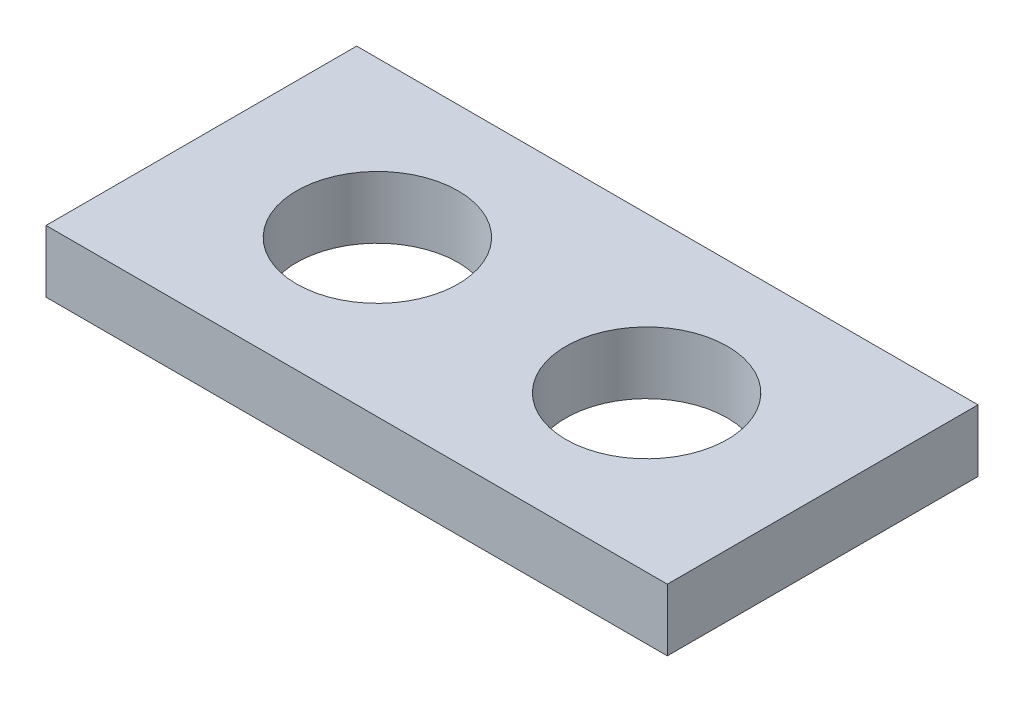
ISO-10303-21;
HEADER;
FILE_DESCRIPTION(('STEP AP214'),'2;1');
FILE_NAME('part.step','',(''),(''),'','','');
FILE_SCHEMA(('AUTOMOTIVE_DESIGN { 1 0 10303 214 1 1 1 1 }'));
ENDSEC;
DATA;
#1=APPLICATION_CONTEXT('core data for automotive mechanical design processes');
#2=APPLICATION_PROTOCOL_DEFINITION('international standard','automotive_design',2000,#1);
#3=PRODUCT_CONTEXT('',#1,'mechanical');
#4=PRODUCT('Part','Part','',(#3));
#5=PRODUCT_RELATED_PRODUCT_CATEGORY('part','',(#4));
#6=PRODUCT_DEFINITION_FORMATION('','',#4);
#7=PRODUCT_DEFINITION_CONTEXT('part definition',#1,'design');
#8=PRODUCT_DEFINITION('design','',#6,#7);
#9=PRODUCT_DEFINITION_SHAPE('','',#8);
#10=(LENGTH_UNIT() NAMED_UNIT(*) SI_UNIT(.MILLI.,.METRE.));
#11=(NAMED_UNIT(*) PLANE_ANGLE_UNIT() SI_UNIT($,.RADIAN.));
#12=(NAMED_UNIT(*) SI_UNIT($,.STERADIAN.) SOLID_ANGLE_UNIT());
#13=UNCERTAINTY_MEASURE_WITH_UNIT(LENGTH_MEASURE(1.E-05),#10,'distance_accuracy_value','');
#14=(GEOMETRIC_REPRESENTATION_CONTEXT(3) GLOBAL_UNCERTAINTY_ASSIGNED_CONTEXT((#13)) GLOBAL_UNIT_ASSIGNED_CONTEXT((#10,
#11,#12)) REPRESENTATION_CONTEXT('',''));
#15=CARTESIAN_POINT('',(0.,0.,0.));
#16=DIRECTION('',(0.,0.,1.));
#17=DIRECTION('',(1.,0.,0.));
#18=AXIS2_PLACEMENT_3D('',#15,#16,#17);
#19=CARTESIAN_POINT('',(15.,3.,7.5));
#20=DIRECTION('',(-1.,0.,0.));
#21=DIRECTION('',(0.,0.,1.));
#22=AXIS2_PLACEMENT_3D('',#19,#20,#21);
#23=PLANE('',#22);
#24=DIRECTION('',(0.,0.,-1.));
#25=VECTOR('',#24,1.);
#26=CARTESIAN_POINT('',(15.,0.,7.5));
#27=LINE('',#26,#25);
#28=CARTESIAN_POINT('',(15.,0.,7.5));
#29=VERTEX_POINT('',#28);
#30=CARTESIAN_POINT('',(15.,0.,-7.5));
#31=VERTEX_POINT('',#30);
#32=EDGE_CURVE('E96',#29,#31,#27,.T.);
#33=ORIENTED_EDGE('',*,*,#32,.T.);
#34=DIRECTION('',(0.,-1.,0.));
#35=VECTOR('',#34,1.);
#36=CARTESIAN_POINT('',(15.,3.,-7.5));
#37=LINE('',#36,#35);
#38=CARTESIAN_POINT('',(15.,3.,-7.5));
#39=VERTEX_POINT('',#38);
#40=EDGE_CURVE('E11',#39,#31,#37,.T.);
#41=ORIENTED_EDGE('',*,*,#40,.F.);
#42=DIRECTION('',(0.,0.,-1.));
#43=VECTOR('',#42,1.);
#44=CARTESIAN_POINT('',(15.,3.,7.5));
#45=LINE('',#44,#43);
#46=CARTESIAN_POINT('',(15.,3.,7.5));
#47=VERTEX_POINT('',#46);
#48=EDGE_CURVE('E84',#47,#39,#45,.T.);
#49=ORIENTED_EDGE('',*,*,#48,.F.);
#50=DIRECTION('',(0.,-1.,0.));
#51=VECTOR('',#50,1.);
#52=CARTESIAN_POINT('',(15.,3.,7.5));
#53=LINE('',#52,#51);
#54=EDGE_CURVE('E92',#47,#29,#53,.T.);
#55=ORIENTED_EDGE('',*,*,#54,.T.);
#56=EDGE_LOOP('',(#33,#41,#49,#55));
#57=FACE_BOUND('',#56,.T.);
#58=ADVANCED_FACE('F33',(#57),#23,.F.);
#59=CARTESIAN_POINT('',(-15.,3.,-7.5));
#60=DIRECTION('',(0.,0.,1.));
#61=DIRECTION('',(1.,0.,0.));
#62=AXIS2_PLACEMENT_3D('',#59,#60,#61);
#63=PLANE('',#62);
#64=DIRECTION('',(-1.,0.,0.));
#65=VECTOR('',#64,1.);
#66=CARTESIAN_POINT('',(-15.,0.,-7.5));
#67=LINE('',#66,#65);
#68=CARTESIAN_POINT('',(-15.,0.,-7.5));
#69=VERTEX_POINT('',#68);
#70=EDGE_CURVE('E88',#31,#69,#67,.T.);
#71=ORIENTED_EDGE('',*,*,#70,.T.);
#72=DIRECTION('',(0.,-1.,0.));
#73=VECTOR('',#72,1.);
#74=CARTESIAN_POINT('',(-15.,3.,-7.5));
#75=LINE('',#74,#73);
#76=CARTESIAN_POINT('',(-15.,3.,-7.5));
#77=VERTEX_POINT('',#76);
#78=EDGE_CURVE('E41',#77,#69,#75,.T.);
#79=ORIENTED_EDGE('',*,*,#78,.F.);
#80=DIRECTION('',(-1.,0.,0.));
#81=VECTOR('',#80,1.);
#82=CARTESIAN_POINT('',(-15.,3.,-7.5));
#83=LINE('',#82,#81);
#84=EDGE_CURVE('E79',#39,#77,#83,.T.);
#85=ORIENTED_EDGE('',*,*,#84,.F.);
#86=ORIENTED_EDGE('',*,*,#40,.T.);
#87=EDGE_LOOP('',(#71,#79,#85,#86));
#88=FACE_BOUND('',#87,.T.);
#89=ADVANCED_FACE('F87',(#88),#63,.F.);
#90=CARTESIAN_POINT('',(-15.,3.,7.5));
#91=DIRECTION('',(1.,0.,0.));
#92=DIRECTION('',(0.,0.,-1.));
#93=AXIS2_PLACEMENT_3D('',#90,#91,#92);
#94=PLANE('',#93);
#95=DIRECTION('',(0.,0.,1.));
#96=VECTOR('',#95,1.);
#97=CARTESIAN_POINT('',(-15.,0.,7.5));
#98=LINE('',#97,#96);
#99=CARTESIAN_POINT('',(-15.,0.,7.5));
#100=VERTEX_POINT('',#99);
#101=EDGE_CURVE('E66',#69,#100,#98,.T.);
#102=ORIENTED_EDGE('',*,*,#101,.T.);
#103=DIRECTION('',(0.,-1.,0.));
#104=VECTOR('',#103,1.);
#105=CARTESIAN_POINT('',(-15.,3.,7.5));
#106=LINE('',#105,#104);
#107=CARTESIAN_POINT('',(-15.,3.,7.5));
#108=VERTEX_POINT('',#107);
#109=EDGE_CURVE('E89',#108,#100,#106,.T.);
#110=ORIENTED_EDGE('',*,*,#109,.F.);
#111=DIRECTION('',(0.,0.,1.));
#112=VECTOR('',#111,1.);
#113=CARTESIAN_POINT('',(-15.,3.,7.5));
#114=LINE('',#113,#112);
#115=EDGE_CURVE('E82',#77,#108,#114,.T.);
#116=ORIENTED_EDGE('',*,*,#115,.F.);
#117=ORIENTED_EDGE('',*,*,#78,.T.);
#118=EDGE_LOOP('',(#102,#110,#116,#117));
#119=FACE_BOUND('',#118,.T.);
#120=ADVANCED_FACE('F90',(#119),#94,.F.);
#121=CARTESIAN_POINT('',(-15.,3.,7.5));
#122=DIRECTION('',(0.,0.,-1.));
#123=DIRECTION('',(-1.,0.,0.));
#124=AXIS2_PLACEMENT_3D('',#121,#122,#123);
#125=PLANE('',#124);
#126=DIRECTION('',(1.,0.,0.));
#127=VECTOR('',#126,1.);
#128=CARTESIAN_POINT('',(-15.,0.,7.5));
#129=LINE('',#128,#127);
#130=EDGE_CURVE('E72',#100,#29,#129,.T.);
#131=ORIENTED_EDGE('',*,*,#130,.T.);
#132=ORIENTED_EDGE('',*,*,#54,.F.);
#133=DIRECTION('',(1.,0.,0.));
#134=VECTOR('',#133,1.);
#135=CARTESIAN_POINT('',(-15.,3.,7.5));
#136=LINE('',#135,#134);
#137=EDGE_CURVE('E49',#108,#47,#136,.T.);
#138=ORIENTED_EDGE('',*,*,#137,.F.);
#139=ORIENTED_EDGE('',*,*,#109,.T.);
#140=EDGE_LOOP('',(#131,#132,#138,#139));
#141=FACE_BOUND('',#140,.T.);
#142=ADVANCED_FACE('F104',(#141),#125,.F.);
#143=CARTESIAN_POINT('',(0.,3.,0.));
#144=DIRECTION('',(0.,-1.,0.));
#145=DIRECTION('',(0.,0.,-1.));
#146=AXIS2_PLACEMENT_3D('',#143,#144,#145);
#147=PLANE('',#146);
#148=CARTESIAN_POINT('',(6.5,3.,0.));
#149=DIRECTION('',(0.,-1.,0.));
#150=DIRECTION('',(0.,0.,-1.));
#151=AXIS2_PLACEMENT_3D('',#148,#149,#150);
#152=CIRCLE('',#151,3.9);
#153=CARTESIAN_POINT('',(6.5,3.,-3.9));
#154=VERTEX_POINT('',#153);
#155=EDGE_CURVE('E115',#154,#154,#152,.F.);
#156=ORIENTED_EDGE('',*,*,#155,.F.);
#157=EDGE_LOOP('',(#156));
#158=FACE_BOUND('',#157,.T.);
#159=CARTESIAN_POINT('',(-6.5,3.,0.));
#160=DIRECTION('',(0.,-1.,0.));
#161=DIRECTION('',(0.,0.,-1.));
#162=AXIS2_PLACEMENT_3D('',#159,#160,#161);
#163=CIRCLE('',#162,3.9);
#164=CARTESIAN_POINT('',(-6.5,3.,-3.9));
#165=VERTEX_POINT('',#164);
#166=EDGE_CURVE('E99',#165,#165,#163,.T.);
#167=ORIENTED_EDGE('',*,*,#166,.T.);
#168=EDGE_LOOP('',(#167));
#169=FACE_BOUND('',#168,.T.);
#170=ORIENTED_EDGE('',*,*,#48,.T.);
#171=ORIENTED_EDGE('',*,*,#84,.T.);
#172=ORIENTED_EDGE('',*,*,#115,.T.);
#173=ORIENTED_EDGE('',*,*,#137,.T.);
#174=EDGE_LOOP('',(#170,#171,#172,#173));
#175=FACE_BOUND('',#174,.T.);
#176=ADVANCED_FACE('F80',(#158,#169,#175),#147,.F.);
#177=CARTESIAN_POINT('',(0.,0.,0.));
#178=DIRECTION('',(0.,-1.,0.));
#179=DIRECTION('',(0.,0.,-1.));
#180=AXIS2_PLACEMENT_3D('',#177,#178,#179);
#181=PLANE('',#180);
#182=CARTESIAN_POINT('',(6.5,0.,0.));
#183=DIRECTION('',(0.,-1.,0.));
#184=DIRECTION('',(0.,0.,1.));
#185=AXIS2_PLACEMENT_3D('',#182,#183,#184);
#186=CIRCLE('',#185,3.9);
#187=CARTESIAN_POINT('',(6.5,0.,3.9));
#188=VERTEX_POINT('',#187);
#189=EDGE_CURVE('E118',#188,#188,#186,.T.);
#190=ORIENTED_EDGE('',*,*,#189,.F.);
#191=EDGE_LOOP('',(#190));
#192=FACE_BOUND('',#191,.T.);
#193=CARTESIAN_POINT('',(-6.5,0.,0.));
#194=DIRECTION('',(0.,1.,0.));
#195=DIRECTION('',(0.,0.,1.));
#196=AXIS2_PLACEMENT_3D('',#193,#194,#195);
#197=CIRCLE('',#196,3.9);
#198=CARTESIAN_POINT('',(-6.5,0.,3.9));
#199=VERTEX_POINT('',#198);
#200=EDGE_CURVE('E112',#199,#199,#197,.T.);
#201=ORIENTED_EDGE('',*,*,#200,.T.);
#202=EDGE_LOOP('',(#201));
#203=FACE_BOUND('',#202,.T.);
#204=ORIENTED_EDGE('',*,*,#32,.F.);
#205=ORIENTED_EDGE('',*,*,#130,.F.);
#206=ORIENTED_EDGE('',*,*,#101,.F.);
#207=ORIENTED_EDGE('',*,*,#70,.F.);
#208=EDGE_LOOP('',(#204,#205,#206,#207));
#209=FACE_BOUND('',#208,.T.);
#210=ADVANCED_FACE('F107',(#192,#203,#209),#181,.T.);
#211=CARTESIAN_POINT('',(-6.5,0.,0.));
#212=DIRECTION('',(0.,1.,0.));
#213=DIRECTION('',(0.,0.,1.));
#214=AXIS2_PLACEMENT_3D('',#211,#212,#213);
#215=CYLINDRICAL_SURFACE('',#214,3.9);
#216=ORIENTED_EDGE('',*,*,#200,.F.);
#217=EDGE_LOOP('',(#216));
#218=FACE_BOUND('',#217,.T.);
#219=ORIENTED_EDGE('',*,*,#166,.F.);
#220=EDGE_LOOP('',(#219));
#221=FACE_BOUND('',#220,.T.);
#222=ADVANCED_FACE('F127',(#218,#221),#215,.F.);
#223=CARTESIAN_POINT('',(6.5,0.,0.));
#224=DIRECTION('',(0.,1.,0.));
#225=DIRECTION('',(0.,0.,1.));
#226=AXIS2_PLACEMENT_3D('',#223,#224,#225);
#227=CYLINDRICAL_SURFACE('',#226,3.9);
#228=ORIENTED_EDGE('',*,*,#189,.T.);
#229=EDGE_LOOP('',(#228));
#230=FACE_BOUND('',#229,.T.);
#231=ORIENTED_EDGE('',*,*,#155,.T.);
#232=EDGE_LOOP('',(#231));
#233=FACE_BOUND('',#232,.T.);
#234=ADVANCED_FACE('F122',(#230,#233),#227,.F.);
#235=CLOSED_SHELL('',(#58,#89,#120,#142,#176,#210,#222,#234));
#236=MANIFOLD_SOLID_BREP('B2',#235);
#237=ADVANCED_BREP_SHAPE_REPRESENTATION('',(#18,#236),#14);
#238=SHAPE_DEFINITION_REPRESENTATION(#9,#237);
ENDSEC;
END-ISO-10303-21;
